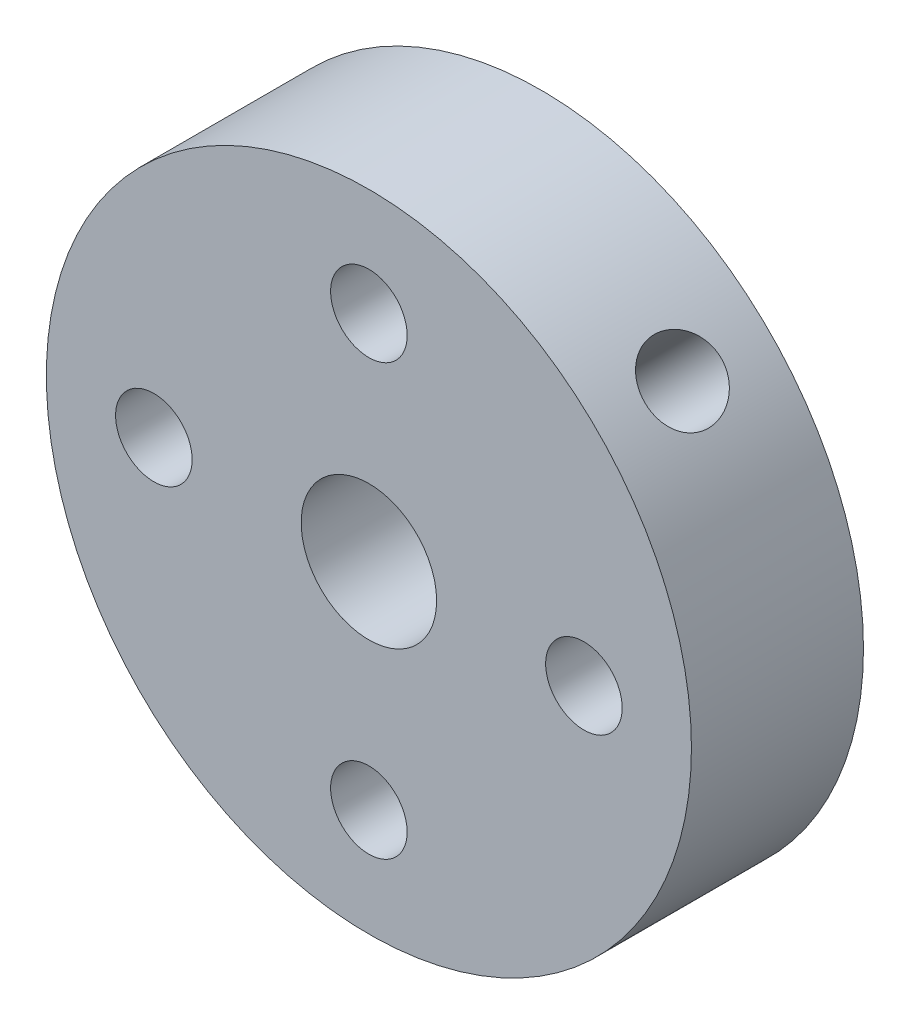
ISO-10303-21;
HEADER;
FILE_DESCRIPTION(('STEP AP214'),'2;1');
FILE_NAME('part.step','',(''),(''),'','','');
FILE_SCHEMA(('AUTOMOTIVE_DESIGN { 1 0 10303 214 1 1 1 1 }'));
ENDSEC;
DATA;
#1=APPLICATION_CONTEXT('core data for automotive mechanical design processes');
#2=APPLICATION_PROTOCOL_DEFINITION('international standard','automotive_design',2000,#1);
#3=PRODUCT_CONTEXT('',#1,'mechanical');
#4=PRODUCT('Part','Part','',(#3));
#5=PRODUCT_RELATED_PRODUCT_CATEGORY('part','',(#4));
#6=PRODUCT_DEFINITION_FORMATION('','',#4);
#7=PRODUCT_DEFINITION_CONTEXT('part definition',#1,'design');
#8=PRODUCT_DEFINITION('design','',#6,#7);
#9=PRODUCT_DEFINITION_SHAPE('','',#8);
#10=(LENGTH_UNIT() NAMED_UNIT(*) SI_UNIT(.MILLI.,.METRE.));
#11=(NAMED_UNIT(*) PLANE_ANGLE_UNIT() SI_UNIT($,.RADIAN.));
#12=(NAMED_UNIT(*) SI_UNIT($,.STERADIAN.) SOLID_ANGLE_UNIT());
#13=UNCERTAINTY_MEASURE_WITH_UNIT(LENGTH_MEASURE(1.E-05),#10,'distance_accuracy_value','');
#14=(GEOMETRIC_REPRESENTATION_CONTEXT(3) GLOBAL_UNCERTAINTY_ASSIGNED_CONTEXT((#13)) GLOBAL_UNIT_ASSIGNED_CONTEXT((#10,
#11,#12)) REPRESENTATION_CONTEXT('',''));
#15=CARTESIAN_POINT('',(0.,0.,0.));
#16=DIRECTION('',(0.,0.,1.));
#17=DIRECTION('',(1.,0.,0.));
#18=AXIS2_PLACEMENT_3D('',#15,#16,#17);
#19=CARTESIAN_POINT('',(0.,0.,5.08));
#20=DIRECTION('',(0.,0.,1.));
#21=DIRECTION('',(1.,0.,0.));
#22=AXIS2_PLACEMENT_3D('',#19,#20,#21);
#23=PLANE('',#22);
#24=CARTESIAN_POINT('',(6.35,0.,5.08));
#25=DIRECTION('',(0.,0.,1.));
#26=DIRECTION('',(1.,0.,0.));
#27=AXIS2_PLACEMENT_3D('',#24,#25,#26);
#28=CIRCLE('',#27,1.1303);
#29=CARTESIAN_POINT('',(7.4803,0.,5.08));
#30=VERTEX_POINT('',#29);
#31=EDGE_CURVE('E65',#30,#30,#28,.T.);
#32=ORIENTED_EDGE('',*,*,#31,.F.);
#33=EDGE_LOOP('',(#32));
#34=FACE_BOUND('',#33,.T.);
#35=CARTESIAN_POINT('',(-6.35,0.,5.08));
#36=DIRECTION('',(0.,0.,1.));
#37=DIRECTION('',(1.,0.,0.));
#38=AXIS2_PLACEMENT_3D('',#35,#36,#37);
#39=CIRCLE('',#38,1.1303);
#40=CARTESIAN_POINT('',(-5.2197,0.,5.08));
#41=VERTEX_POINT('',#40);
#42=EDGE_CURVE('E53',#41,#41,#39,.T.);
#43=ORIENTED_EDGE('',*,*,#42,.F.);
#44=EDGE_LOOP('',(#43));
#45=FACE_BOUND('',#44,.T.);
#46=CARTESIAN_POINT('',(0.,0.,5.08));
#47=DIRECTION('',(0.,0.,1.));
#48=DIRECTION('',(1.,0.,0.));
#49=AXIS2_PLACEMENT_3D('',#46,#47,#48);
#50=CIRCLE('',#49,9.525);
#51=CARTESIAN_POINT('',(9.525,0.,5.08));
#52=VERTEX_POINT('',#51);
#53=EDGE_CURVE('E10',#52,#52,#50,.T.);
#54=ORIENTED_EDGE('',*,*,#53,.T.);
#55=EDGE_LOOP('',(#54));
#56=FACE_BOUND('',#55,.T.);
#57=CARTESIAN_POINT('',(0.,0.,5.08));
#58=DIRECTION('',(0.,0.,1.));
#59=DIRECTION('',(1.,0.,0.));
#60=AXIS2_PLACEMENT_3D('',#57,#58,#59);
#61=CIRCLE('',#60,2.);
#62=CARTESIAN_POINT('',(2.,0.,5.08));
#63=VERTEX_POINT('',#62);
#64=EDGE_CURVE('E48',#63,#63,#61,.T.);
#65=ORIENTED_EDGE('',*,*,#64,.F.);
#66=EDGE_LOOP('',(#65));
#67=FACE_BOUND('',#66,.T.);
#68=CARTESIAN_POINT('',(0.,6.35,5.08));
#69=DIRECTION('',(0.,0.,1.));
#70=DIRECTION('',(1.,0.,0.));
#71=AXIS2_PLACEMENT_3D('',#68,#69,#70);
#72=CIRCLE('',#71,1.1303);
#73=CARTESIAN_POINT('',(1.13030000000002,6.35,5.08));
#74=VERTEX_POINT('',#73);
#75=EDGE_CURVE('E59',#74,#74,#72,.T.);
#76=ORIENTED_EDGE('',*,*,#75,.F.);
#77=EDGE_LOOP('',(#76));
#78=FACE_BOUND('',#77,.T.);
#79=CARTESIAN_POINT('',(0.,-6.35,5.08));
#80=DIRECTION('',(0.,0.,1.));
#81=DIRECTION('',(1.,0.,0.));
#82=AXIS2_PLACEMENT_3D('',#79,#80,#81);
#83=CIRCLE('',#82,1.1303);
#84=CARTESIAN_POINT('',(1.13029999999993,-6.35,5.08));
#85=VERTEX_POINT('',#84);
#86=EDGE_CURVE('E71',#85,#85,#83,.T.);
#87=ORIENTED_EDGE('',*,*,#86,.F.);
#88=EDGE_LOOP('',(#87));
#89=FACE_BOUND('',#88,.T.);
#90=ADVANCED_FACE('F30',(#34,#45,#56,#67,#78,#89),#23,.T.);
#91=CARTESIAN_POINT('',(0.,0.,0.));
#92=DIRECTION('',(0.,0.,1.));
#93=DIRECTION('',(1.,0.,0.));
#94=AXIS2_PLACEMENT_3D('',#91,#92,#93);
#95=PLANE('',#94);
#96=CARTESIAN_POINT('',(6.35,0.,0.));
#97=DIRECTION('',(0.,0.,1.));
#98=DIRECTION('',(1.,0.,0.));
#99=AXIS2_PLACEMENT_3D('',#96,#97,#98);
#100=CIRCLE('',#99,1.1303);
#101=CARTESIAN_POINT('',(7.4803,0.,0.));
#102=VERTEX_POINT('',#101);
#103=EDGE_CURVE('E68',#102,#102,#100,.T.);
#104=ORIENTED_EDGE('',*,*,#103,.T.);
#105=EDGE_LOOP('',(#104));
#106=FACE_BOUND('',#105,.T.);
#107=CARTESIAN_POINT('',(-6.35,0.,0.));
#108=DIRECTION('',(0.,0.,1.));
#109=DIRECTION('',(1.,0.,0.));
#110=AXIS2_PLACEMENT_3D('',#107,#108,#109);
#111=CIRCLE('',#110,1.1303);
#112=CARTESIAN_POINT('',(-5.2197,0.,0.));
#113=VERTEX_POINT('',#112);
#114=EDGE_CURVE('E56',#113,#113,#111,.T.);
#115=ORIENTED_EDGE('',*,*,#114,.T.);
#116=EDGE_LOOP('',(#115));
#117=FACE_BOUND('',#116,.T.);
#118=CARTESIAN_POINT('',(0.,0.,0.));
#119=DIRECTION('',(0.,0.,1.));
#120=DIRECTION('',(1.,0.,0.));
#121=AXIS2_PLACEMENT_3D('',#118,#119,#120);
#122=CIRCLE('',#121,9.525);
#123=CARTESIAN_POINT('',(9.525,0.,0.));
#124=VERTEX_POINT('',#123);
#125=EDGE_CURVE('E43',#124,#124,#122,.T.);
#126=ORIENTED_EDGE('',*,*,#125,.F.);
#127=EDGE_LOOP('',(#126));
#128=FACE_BOUND('',#127,.T.);
#129=CARTESIAN_POINT('',(0.,0.,0.));
#130=DIRECTION('',(0.,0.,1.));
#131=DIRECTION('',(1.,0.,0.));
#132=AXIS2_PLACEMENT_3D('',#129,#130,#131);
#133=CIRCLE('',#132,2.);
#134=CARTESIAN_POINT('',(2.,0.,0.));
#135=VERTEX_POINT('',#134);
#136=EDGE_CURVE('E50',#135,#135,#133,.T.);
#137=ORIENTED_EDGE('',*,*,#136,.T.);
#138=EDGE_LOOP('',(#137));
#139=FACE_BOUND('',#138,.T.);
#140=CARTESIAN_POINT('',(0.,6.35,0.));
#141=DIRECTION('',(0.,0.,1.));
#142=DIRECTION('',(1.,0.,0.));
#143=AXIS2_PLACEMENT_3D('',#140,#141,#142);
#144=CIRCLE('',#143,1.1303);
#145=CARTESIAN_POINT('',(1.13030000000002,6.35,0.));
#146=VERTEX_POINT('',#145);
#147=EDGE_CURVE('E62',#146,#146,#144,.T.);
#148=ORIENTED_EDGE('',*,*,#147,.T.);
#149=EDGE_LOOP('',(#148));
#150=FACE_BOUND('',#149,.T.);
#151=CARTESIAN_POINT('',(0.,-6.35,0.));
#152=DIRECTION('',(0.,0.,1.));
#153=DIRECTION('',(1.,0.,0.));
#154=AXIS2_PLACEMENT_3D('',#151,#152,#153);
#155=CIRCLE('',#154,1.1303);
#156=CARTESIAN_POINT('',(1.13029999999993,-6.35,0.));
#157=VERTEX_POINT('',#156);
#158=EDGE_CURVE('E74',#157,#157,#155,.T.);
#159=ORIENTED_EDGE('',*,*,#158,.T.);
#160=EDGE_LOOP('',(#159));
#161=FACE_BOUND('',#160,.T.);
#162=ADVANCED_FACE('F110',(#106,#117,#128,#139,#150,#161),#95,.F.);
#163=CARTESIAN_POINT('',(0.,0.,5.08));
#164=DIRECTION('',(0.,0.,-1.));
#165=DIRECTION('',(-1.,0.,0.));
#166=AXIS2_PLACEMENT_3D('',#163,#164,#165);
#167=CYLINDRICAL_SURFACE('',#166,9.525);
#168=CARTESIAN_POINT('',(5.88835942537819,7.48684501492851,2.54));
#169=CARTESIAN_POINT('',(5.88836195095317,7.48684371644301,2.47675083023152));
#170=CARTESIAN_POINT('',(5.89257955251751,7.48353185659465,2.41346150046686));
#171=CARTESIAN_POINT('',(5.90930099826138,7.47033438245385,2.28864237142658));
#172=CARTESIAN_POINT('',(5.92181363090027,7.46044179594316,2.22711451060301));
#173=CARTESIAN_POINT('',(5.95464092558272,7.43426622977027,2.10764367538076));
#174=CARTESIAN_POINT('',(5.97495044743216,7.4179874601227,2.04969836829954));
#175=CARTESIAN_POINT('',(6.02261482930935,7.37934092821963,1.93898333748816));
#176=CARTESIAN_POINT('',(6.04996843169233,7.35697425285361,1.88621269219769));
#177=CARTESIAN_POINT('',(6.11088325226502,7.30645598401452,1.78706674838293));
#178=CARTESIAN_POINT('',(6.14447193256567,7.27827873476532,1.74072139175397));
#179=CARTESIAN_POINT('',(6.21661016004974,7.2167600545004,1.65600003105462));
#180=CARTESIAN_POINT('',(6.25515994832758,7.18341837249326,1.61762441452585));
#181=CARTESIAN_POINT('',(6.33604808507048,7.11217466377855,1.54982538353728));
#182=CARTESIAN_POINT('',(6.3783973580081,7.07425937164084,1.52042892784532));
#183=CARTESIAN_POINT('',(6.46540207301569,6.99483143682025,1.47159528680366));
#184=CARTESIAN_POINT('',(6.5100574375236,6.95331891509317,1.45215776673944));
#185=CARTESIAN_POINT('',(6.60005194815221,6.86795208289868,1.42388283449897));
#186=CARTESIAN_POINT('',(6.64538686637488,6.82410976435156,1.41499577009914));
#187=CARTESIAN_POINT('',(6.73558439792912,6.73509773549741,1.40792020794054));
#188=CARTESIAN_POINT('',(6.7804470280509,6.68992807259647,1.40973132855718));
#189=CARTESIAN_POINT('',(6.86820386152361,6.599798372251,1.42396079393402));
#190=CARTESIAN_POINT('',(6.91110683052498,6.55483842314752,1.4363257418347));
#191=CARTESIAN_POINT('',(6.9940586173456,6.46625499744921,1.47122847396179));
#192=CARTESIAN_POINT('',(7.0341073854703,6.42263154413169,1.49376643526071));
#193=CARTESIAN_POINT('',(7.11047389982341,6.33798444025193,1.54843268947244));
#194=CARTESIAN_POINT('',(7.14678231052368,6.29696738819746,1.5805842326774));
#195=CARTESIAN_POINT('',(7.21474731577014,6.21898110942085,1.65354808279929));
#196=CARTESIAN_POINT('',(7.24640371790586,6.18201205014275,1.69436074777599));
#197=CARTESIAN_POINT('',(7.30459052177825,6.1131523151431,1.78378773040749));
#198=CARTESIAN_POINT('',(7.33108814330646,6.08129432791138,1.83244856131957));
#199=CARTESIAN_POINT('',(7.37819326489261,6.02405740006055,1.93603038653666));
#200=CARTESIAN_POINT('',(7.39880074961866,5.99867847630631,1.99095139713625));
#201=CARTESIAN_POINT('',(7.43374431095623,5.95532114846176,2.1055342677617));
#202=CARTESIAN_POINT('',(7.44807813319183,5.93734540476463,2.16519782288701));
#203=CARTESIAN_POINT('',(7.47019783719619,5.90949139153398,2.28755178056522));
#204=CARTESIAN_POINT('',(7.47798400239078,5.89961277150397,2.35024205197765));
#205=CARTESIAN_POINT('',(7.48683917624636,5.88837124710133,2.47646170976712));
#206=CARTESIAN_POINT('',(7.48794874725196,5.88695691985536,2.53998367450721));
#207=CARTESIAN_POINT('',(7.48353900948199,5.89256150655298,2.66642145646119));
#208=CARTESIAN_POINT('',(7.47801982772236,5.89958025890725,2.72933728526618));
#209=CARTESIAN_POINT('',(7.4604797638959,5.92174496154769,2.85258339037514));
#210=CARTESIAN_POINT('',(7.44847854956712,5.93686632585195,2.91292089524452));
#211=CARTESIAN_POINT('',(7.41820432802201,5.9746507992698,3.02952333352779));
#212=CARTESIAN_POINT('',(7.39993112116802,5.99731414844423,3.08578813723847));
#213=CARTESIAN_POINT('',(7.3573459879704,6.04948095685633,3.1929429018076));
#214=CARTESIAN_POINT('',(7.33300567509898,6.0790165250561,3.24380594689318));
#215=CARTESIAN_POINT('',(7.27879532574687,6.14382158701823,3.33843921221188));
#216=CARTESIAN_POINT('',(7.24892509577832,6.17909128140833,3.38220918416288));
#217=CARTESIAN_POINT('',(7.18409133135529,6.25435300526256,3.46164117510913));
#218=CARTESIAN_POINT('',(7.14910250445824,6.29436828646216,3.49726053799617));
#219=CARTESIAN_POINT('',(7.07491631826807,6.3776397837772,3.55908550257747));
#220=CARTESIAN_POINT('',(7.03571903657591,6.42089594012874,3.58529127781298));
#221=CARTESIAN_POINT('',(6.95415461445161,6.50914409325839,3.62747423592636));
#222=CARTESIAN_POINT('',(6.91179549296077,6.55413156743956,3.64347637414357));
#223=CARTESIAN_POINT('',(6.82492284724016,6.64454523148135,3.66487907550036));
#224=CARTESIAN_POINT('',(6.78040941016546,6.68997140353457,3.67028006715352));
#225=CARTESIAN_POINT('',(6.69074810034106,6.77963941018955,3.67031970142616));
#226=CARTESIAN_POINT('',(6.64560580297417,6.82388680503418,3.66502423763516));
#227=CARTESIAN_POINT('',(6.55574227788335,6.91026438272434,3.64396046052651));
#228=CARTESIAN_POINT('',(6.51102105005992,6.95239456607021,3.62819214968382));
#229=CARTESIAN_POINT('',(6.42338189252386,7.03344543435096,3.58665033089502));
#230=CARTESIAN_POINT('',(6.38046345683568,7.07236702280911,3.5608796513112));
#231=CARTESIAN_POINT('',(6.29777674855962,7.1460972155007,3.50007146474908));
#232=CARTESIAN_POINT('',(6.25800849834253,7.18090579052678,3.46503389197037));
#233=CARTESIAN_POINT('',(6.18270115855429,7.24584863898786,3.38644164568462));
#234=CARTESIAN_POINT('',(6.14718843076923,7.27595409486117,3.34283789712583));
#235=CARTESIAN_POINT('',(6.08187599996231,7.33063630645185,3.24845211130754));
#236=CARTESIAN_POINT('',(6.05207765639619,7.35521174681543,3.19766837090296));
#237=CARTESIAN_POINT('',(5.99917191408572,7.3984279339773,3.09016285265355));
#238=CARTESIAN_POINT('',(5.97608822328395,7.41704767502981,3.03342097479024));
#239=CARTESIAN_POINT('',(5.93763032888588,7.44787110310117,2.91578612799387));
#240=CARTESIAN_POINT('',(5.92224765516634,7.46008183991524,2.85489780375564));
#241=CARTESIAN_POINT('',(5.90349319273591,7.47492339005222,2.75140489514775));
#242=CARTESIAN_POINT('',(5.89782818173787,7.47938976260326,2.70945572036591));
#243=CARTESIAN_POINT('',(5.8902604616154,7.48535100167703,2.62501040961091));
#244=CARTESIAN_POINT('',(5.88835772775915,7.4868458877332,2.58251427723511));
#245=CARTESIAN_POINT('',(5.88835942537819,7.48684501492851,2.54));
#246=B_SPLINE_CURVE_WITH_KNOTS('',3,(#168,#169,#170,#171,#172,#173,#174,#175,#176,#177,#178,
#179,#180,#181,#182,#183,#184,#185,#186,#187,#188,#189,#190,#191,#192,#193,#194,#195,#196,#197,
#198,#199,#200,#201,#202,#203,#204,#205,#206,#207,#208,#209,#210,#211,#212,#213,#214,#215,#216,
#217,#218,#219,#220,#221,#222,#223,#224,#225,#226,#227,#228,#229,#230,#231,#232,#233,#234,#235,
#236,#237,#238,#239,#240,#241,#242,#243,#244,#245),.UNSPECIFIED.,.T.,.F.,(4,2,2,2,2,2,2,2,2,2,2,
2,2,2,2,2,2,2,2,2,2,2,2,2,2,2,2,2,2,2,2,2,2,2,2,2,2,2,4),(0.,0.18959221388925,0.379385619561867,
0.569054115897611,0.758688772414149,0.949179385544421,1.13967925942422,1.33074558653033,
1.52180549157747,1.71196262630948,1.90211297781599,2.09130693212656,2.28050417969351,
2.4701627505348,2.65982916358627,2.85066401887306,3.04149937089376,3.23240324144272,
3.42329884798683,3.61303352504166,3.80276456657904,3.99192313524191,4.18108772538462,
4.37115455334501,4.56122803286597,4.7522745994211,4.94331764381635,5.13389163804311,
5.32445792883671,5.51385385073963,5.70324972788426,5.89259208867053,6.08193579393566,
6.27239765084127,6.46290476268864,6.65407656758035,6.84503764369971,6.97247692802296,
7.09991537460509),.UNSPECIFIED.);
#247=CARTESIAN_POINT('',(5.88835942537819,7.48684501492851,2.54));
#248=VERTEX_POINT('',#247);
#249=EDGE_CURVE('E77',#248,#248,#246,.T.);
#250=ORIENTED_EDGE('',*,*,#249,.T.);
#251=EDGE_LOOP('',(#250));
#252=FACE_BOUND('',#251,.T.);
#253=ORIENTED_EDGE('',*,*,#53,.F.);
#254=EDGE_LOOP('',(#253));
#255=FACE_BOUND('',#254,.T.);
#256=ORIENTED_EDGE('',*,*,#125,.T.);
#257=EDGE_LOOP('',(#256));
#258=FACE_BOUND('',#257,.T.);
#259=ADVANCED_FACE('F32',(#252,#255,#258),#167,.T.);
#260=CARTESIAN_POINT('',(0.,0.,5.08));
#261=DIRECTION('',(0.,0.,-1.));
#262=DIRECTION('',(-1.,0.,0.));
#263=AXIS2_PLACEMENT_3D('',#260,#261,#262);
#264=CYLINDRICAL_SURFACE('',#263,2.);
#265=CARTESIAN_POINT('',(0.367466661344919,1.96595225089523,2.54));
#266=CARTESIAN_POINT('',(0.367469796813495,1.96595288226126,2.48235721050688));
#267=CARTESIAN_POINT('',(0.372772464971211,1.96498290328754,2.42470129890544));
#268=CARTESIAN_POINT('',(0.393425057028185,1.96094900430477,2.31127590572929));
#269=CARTESIAN_POINT('',(0.40878600490776,1.95788278663336,2.25550856466133));
#270=CARTESIAN_POINT('',(0.448030525054973,1.94927289384264,2.14771379484587));
#271=CARTESIAN_POINT('',(0.471859939422233,1.94374490674539,2.09566506835939));
#272=CARTESIAN_POINT('',(0.526450120750283,1.92967438790692,1.99580784162425));
#273=CARTESIAN_POINT('',(0.557213079437348,1.92113090246794,1.94800068883125));
#274=CARTESIAN_POINT('',(0.62776415232903,1.89931967200514,1.85235593740766));
#275=CARTESIAN_POINT('',(0.66816615129895,1.88564377253232,1.805064093406));
#276=CARTESIAN_POINT('',(0.753843747822659,1.85305758658984,1.71712247036296));
#277=CARTESIAN_POINT('',(0.799122391809093,1.83414401642923,1.67647688361652));
#278=CARTESIAN_POINT('',(0.897200713041526,1.78835648342144,1.59928818834819));
#279=CARTESIAN_POINT('',(0.950308960755301,1.7609095577645,1.56346832075461));
#280=CARTESIAN_POINT('',(1.05799721275853,1.69838319254608,1.50217536674408));
#281=CARTESIAN_POINT('',(1.11257599026981,1.66330995239748,1.47669392418393));
#282=CARTESIAN_POINT('',(1.21595846618257,1.58906772426166,1.43914233517405));
#283=CARTESIAN_POINT('',(1.26485195909276,1.55051924757064,1.42609940980754));
#284=CARTESIAN_POINT('',(1.35968398481181,1.46805841375092,1.41053750414546));
#285=CARTESIAN_POINT('',(1.40562487338845,1.42415041595702,1.40801002872237));
#286=CARTESIAN_POINT('',(1.48795538556206,1.3375953353256,1.41330243256011));
#287=CARTESIAN_POINT('',(1.5248395380158,1.2953441467364,1.42001083697577));
#288=CARTESIAN_POINT('',(1.59402206500385,1.20919219785778,1.44151793298605));
#289=CARTESIAN_POINT('',(1.62632010255697,1.16529131665072,1.45631721869997));
#290=CARTESIAN_POINT('',(1.68619532991075,1.07685984467915,1.49354831362181));
#291=CARTESIAN_POINT('',(1.71372491028095,1.03232722788112,1.51605108455523));
#292=CARTESIAN_POINT('',(1.76370074507378,0.94441524750481,1.56788094100558));
#293=CARTESIAN_POINT('',(1.78614545976777,0.90103623674573,1.5972100881554));
#294=CARTESIAN_POINT('',(1.82849143768828,0.811980699796413,1.66557489987538));
#295=CARTESIAN_POINT('',(1.84782970625323,0.766587652642932,1.70532836539113));
#296=CARTESIAN_POINT('',(1.88127495123675,0.680401798859257,1.79154578239276));
#297=CARTESIAN_POINT('',(1.89537569798358,0.639614510320813,1.83801763428868));
#298=CARTESIAN_POINT('',(1.92024776574855,0.560815248989715,1.94170265097221));
#299=CARTESIAN_POINT('',(1.93056841902368,0.523447518475695,1.9995190240627));
#300=CARTESIAN_POINT('',(1.94687234124287,0.459127219923682,2.12121679026231));
#301=CARTESIAN_POINT('',(1.95286320553351,0.432156452444812,2.18508733928911));
#302=CARTESIAN_POINT('',(1.96048049921216,0.395951506025223,2.30228591254559));
#303=CARTESIAN_POINT('',(1.9627848973695,0.384094479903822,2.35476062144389));
#304=CARTESIAN_POINT('',(1.96563023630636,0.369267670965051,2.46098259161437));
#305=CARTESIAN_POINT('',(1.96617279629187,0.366289728089751,2.51472863867662));
#306=CARTESIAN_POINT('',(1.96557333486648,0.369490374418399,2.62195410703307));
#307=CARTESIAN_POINT('',(1.96443056135405,0.375673051671504,2.67543339859608));
#308=CARTESIAN_POINT('',(1.96030411864185,0.39663367914801,2.7806136442152));
#309=CARTESIAN_POINT('',(1.95731913552099,0.411417763730605,2.83231330116978));
#310=CARTESIAN_POINT('',(1.94910810702702,0.448713721369055,2.9335103984712));
#311=CARTESIAN_POINT('',(1.94384898934396,0.47133861817049,2.98296294965967));
#312=CARTESIAN_POINT('',(1.93062082214848,0.522886548130614,3.07806088023951));
#313=CARTESIAN_POINT('',(1.92265064924703,0.55181219036055,3.1237046716026));
#314=CARTESIAN_POINT('',(1.9019225593483,0.619796809383486,3.21775291115333));
#315=CARTESIAN_POINT('',(1.88859614540959,0.659738947345635,3.26539544327375));
#316=CARTESIAN_POINT('',(1.85677727007002,0.744603598545832,3.35411733628725));
#317=CARTESIAN_POINT('',(1.83828069023369,0.789530064908111,3.39519142373205));
#318=CARTESIAN_POINT('',(1.79339208742894,0.887066256091514,3.47343442051247));
#319=CARTESIAN_POINT('',(1.76642184847191,0.940001326059562,3.50987467941604));
#320=CARTESIAN_POINT('',(1.7048667216549,1.04749853073205,3.57249838849152));
#321=CARTESIAN_POINT('',(1.67028801011076,1.10205931485096,3.59869011045946));
#322=CARTESIAN_POINT('',(1.5967906897217,1.20580263095864,3.63776441042464));
#323=CARTESIAN_POINT('',(1.55846688759984,1.25505700347852,3.65156798921066));
#324=CARTESIAN_POINT('',(1.47632439561899,1.35071387808568,3.66858448818166));
#325=CARTESIAN_POINT('',(1.43251033058913,1.39711873206449,3.67180626071963));
#326=CARTESIAN_POINT('',(1.34609835622707,1.48027289271462,3.66772533315737));
#327=CARTESIAN_POINT('',(1.30391972717075,1.51752099235784,3.66156764604882));
#328=CARTESIAN_POINT('',(1.21781029488282,1.58745528710618,3.64109388051504));
#329=CARTESIAN_POINT('',(1.17387938788475,1.62014121153097,3.62677731826812));
#330=CARTESIAN_POINT('',(1.08549260093224,1.68065237875243,3.59051840067738));
#331=CARTESIAN_POINT('',(1.04103519324213,1.7084524312556,3.56853817370264));
#332=CARTESIAN_POINT('',(0.953181807344802,1.75898157056552,3.51773403997969));
#333=CARTESIAN_POINT('',(0.909786137301627,1.78170920031491,3.48890817171113));
#334=CARTESIAN_POINT('',(0.820676063574802,1.82460842457799,3.42164679657105));
#335=CARTESIAN_POINT('',(0.775229224679488,1.84422642730733,3.38250414123616));
#336=CARTESIAN_POINT('',(0.688789309248772,1.87822568820466,3.2975118741746));
#337=CARTESIAN_POINT('',(0.647801639873065,1.89260063727007,3.25165427452177));
#338=CARTESIAN_POINT('',(0.568269435503897,1.91806681149674,3.14909677807817));
#339=CARTESIAN_POINT('',(0.530373552791632,1.92868912257257,3.09177211133407));
#340=CARTESIAN_POINT('',(0.464795450505886,1.94553836491796,2.97099110802815));
#341=CARTESIAN_POINT('',(0.437094620404753,1.95177332423795,2.90754621362511));
#342=CARTESIAN_POINT('',(0.400147751650427,1.95962755540473,2.79325736152766));
#343=CARTESIAN_POINT('',(0.387979816878751,1.96202414581381,2.74340721220073));
#344=CARTESIAN_POINT('',(0.371640896015276,1.96518559766214,2.64237413504364));
#345=CARTESIAN_POINT('',(0.367463876752631,1.96595169018256,2.59119224230252));
#346=CARTESIAN_POINT('',(0.367466661344919,1.96595225089523,2.54));
#347=B_SPLINE_CURVE_WITH_KNOTS('',3,(#265,#266,#267,#268,#269,#270,#271,#272,#273,#274,#275,
#276,#277,#278,#279,#280,#281,#282,#283,#284,#285,#286,#287,#288,#289,#290,#291,#292,#293,#294,
#295,#296,#297,#298,#299,#300,#301,#302,#303,#304,#305,#306,#307,#308,#309,#310,#311,#312,#313,
#314,#315,#316,#317,#318,#319,#320,#321,#322,#323,#324,#325,#326,#327,#328,#329,#330,#331,#332,
#333,#334,#335,#336,#337,#338,#339,#340,#341,#342,#343,#344,#345,#346),.UNSPECIFIED.,.T.,.F.,(4,
2,2,2,2,2,2,2,2,2,2,2,2,2,2,2,2,2,2,2,2,2,2,2,2,2,2,2,2,2,2,2,2,2,2,2,2,2,2,2,4),(0.,
0.172714547215531,0.345618708955109,0.517436437246626,0.689308554301198,0.87959907579275,
1.07000916864728,1.27796638228384,1.48575517580491,1.67549260046226,1.86507671194829,
2.03373205128987,2.2023997767796,2.37266499075217,2.5429816933737,2.73229686398524,
2.92183649631279,3.1296061544957,3.33701045113427,3.49784081446661,3.65852332579862,
3.81927756544952,3.98014659273003,4.14343822659733,4.30679760676135,4.49677368850957,
4.68690153423371,4.89487903568528,5.10268832642678,5.29332411666533,5.48380038728327,
5.65281337261856,5.82183638147514,5.99170677739715,6.1616259060982,6.350178142012,
6.53895652496093,6.74651430024832,6.95369128819529,7.10719406259539,7.26058089602202),.UNSPECIFIED.);
#348=CARTESIAN_POINT('',(0.367466661344919,1.96595225089523,2.54));
#349=VERTEX_POINT('',#348);
#350=EDGE_CURVE('E35',#349,#349,#347,.T.);
#351=ORIENTED_EDGE('',*,*,#350,.F.);
#352=EDGE_LOOP('',(#351));
#353=FACE_BOUND('',#352,.T.);
#354=ORIENTED_EDGE('',*,*,#64,.T.);
#355=EDGE_LOOP('',(#354));
#356=FACE_BOUND('',#355,.T.);
#357=ORIENTED_EDGE('',*,*,#136,.F.);
#358=EDGE_LOOP('',(#357));
#359=FACE_BOUND('',#358,.T.);
#360=ADVANCED_FACE('F103',(#353,#356,#359),#264,.F.);
#361=CARTESIAN_POINT('',(-6.35,0.,5.08));
#362=DIRECTION('',(0.,0.,-1.));
#363=DIRECTION('',(-1.,0.,0.));
#364=AXIS2_PLACEMENT_3D('',#361,#362,#363);
#365=CYLINDRICAL_SURFACE('',#364,1.1303);
#366=ORIENTED_EDGE('',*,*,#42,.T.);
#367=EDGE_LOOP('',(#366));
#368=FACE_BOUND('',#367,.T.);
#369=ORIENTED_EDGE('',*,*,#114,.F.);
#370=EDGE_LOOP('',(#369));
#371=FACE_BOUND('',#370,.T.);
#372=ADVANCED_FACE('F100',(#368,#371),#365,.F.);
#373=CARTESIAN_POINT('',(0.,6.35,5.08));
#374=DIRECTION('',(0.,0.,-1.));
#375=DIRECTION('',(-1.,0.,0.));
#376=AXIS2_PLACEMENT_3D('',#373,#374,#375);
#377=CYLINDRICAL_SURFACE('',#376,1.1303);
#378=ORIENTED_EDGE('',*,*,#75,.T.);
#379=EDGE_LOOP('',(#378));
#380=FACE_BOUND('',#379,.T.);
#381=ORIENTED_EDGE('',*,*,#147,.F.);
#382=EDGE_LOOP('',(#381));
#383=FACE_BOUND('',#382,.T.);
#384=ADVANCED_FACE('F96',(#380,#383),#377,.F.);
#385=CARTESIAN_POINT('',(6.35,0.,5.08));
#386=DIRECTION('',(0.,0.,-1.));
#387=DIRECTION('',(-1.,0.,0.));
#388=AXIS2_PLACEMENT_3D('',#385,#386,#387);
#389=CYLINDRICAL_SURFACE('',#388,1.1303);
#390=ORIENTED_EDGE('',*,*,#31,.T.);
#391=EDGE_LOOP('',(#390));
#392=FACE_BOUND('',#391,.T.);
#393=ORIENTED_EDGE('',*,*,#103,.F.);
#394=EDGE_LOOP('',(#393));
#395=FACE_BOUND('',#394,.T.);
#396=ADVANCED_FACE('F92',(#392,#395),#389,.F.);
#397=CARTESIAN_POINT('',(0.,-6.35,5.08));
#398=DIRECTION('',(0.,0.,-1.));
#399=DIRECTION('',(-1.,0.,0.));
#400=AXIS2_PLACEMENT_3D('',#397,#398,#399);
#401=CYLINDRICAL_SURFACE('',#400,1.1303);
#402=ORIENTED_EDGE('',*,*,#86,.T.);
#403=EDGE_LOOP('',(#402));
#404=FACE_BOUND('',#403,.T.);
#405=ORIENTED_EDGE('',*,*,#158,.F.);
#406=EDGE_LOOP('',(#405));
#407=FACE_BOUND('',#406,.T.);
#408=ADVANCED_FACE('F87',(#404,#407),#401,.F.);
#409=CARTESIAN_POINT('',(-0.449012806053457,-0.449012806053455,2.54));
#410=DIRECTION('',(0.707106781186548,0.707106781186548,0.));
#411=DIRECTION('',(-0.707106781186548,0.707106781186548,0.));
#412=AXIS2_PLACEMENT_3D('',#409,#410,#411);
#413=CYLINDRICAL_SURFACE('',#412,1.1303);
#414=ORIENTED_EDGE('',*,*,#350,.T.);
#415=EDGE_LOOP('',(#414));
#416=FACE_BOUND('',#415,.T.);
#417=ORIENTED_EDGE('',*,*,#249,.F.);
#418=EDGE_LOOP('',(#417));
#419=FACE_BOUND('',#418,.T.);
#420=ADVANCED_FACE('F83',(#416,#419),#413,.F.);
#421=CLOSED_SHELL('',(#90,#162,#259,#360,#372,#384,#396,#408,#420));
#422=MANIFOLD_SOLID_BREP('B2',#421);
#423=ADVANCED_BREP_SHAPE_REPRESENTATION('',(#18,#422),#14);
#424=SHAPE_DEFINITION_REPRESENTATION(#9,#423);
ENDSEC;
END-ISO-10303-21;
